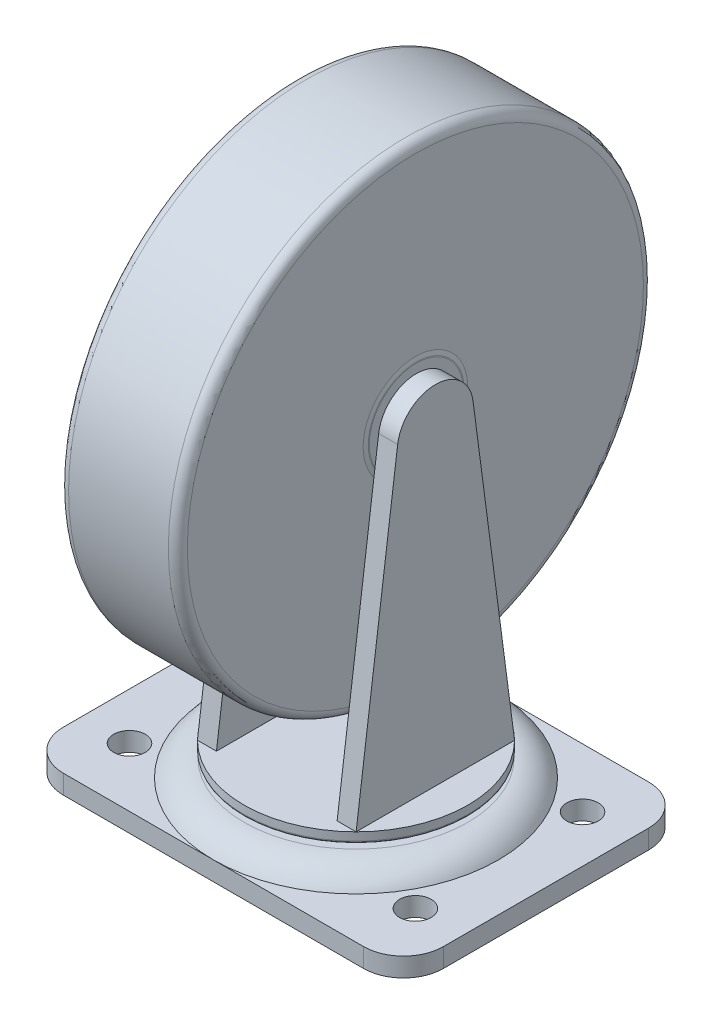
ISO-10303-21;
HEADER;
FILE_DESCRIPTION(('STEP AP214'),'2;1');
FILE_NAME('part.step','',(''),(''),'','','');
FILE_SCHEMA(('AUTOMOTIVE_DESIGN { 1 0 10303 214 1 1 1 1 }'));
ENDSEC;
DATA;
#1=APPLICATION_CONTEXT('core data for automotive mechanical design processes');
#2=APPLICATION_PROTOCOL_DEFINITION('international standard','automotive_design',2000,#1);
#3=PRODUCT_CONTEXT('',#1,'mechanical');
#4=PRODUCT('Part','Part','',(#3));
#5=PRODUCT_RELATED_PRODUCT_CATEGORY('part','',(#4));
#6=PRODUCT_DEFINITION_FORMATION('','',#4);
#7=PRODUCT_DEFINITION_CONTEXT('part definition',#1,'design');
#8=PRODUCT_DEFINITION('design','',#6,#7);
#9=PRODUCT_DEFINITION_SHAPE('','',#8);
#10=(LENGTH_UNIT() NAMED_UNIT(*) SI_UNIT(.MILLI.,.METRE.));
#11=(NAMED_UNIT(*) PLANE_ANGLE_UNIT() SI_UNIT($,.RADIAN.));
#12=(NAMED_UNIT(*) SI_UNIT($,.STERADIAN.) SOLID_ANGLE_UNIT());
#13=UNCERTAINTY_MEASURE_WITH_UNIT(LENGTH_MEASURE(1.E-05),#10,'distance_accuracy_value','');
#14=(GEOMETRIC_REPRESENTATION_CONTEXT(3) GLOBAL_UNCERTAINTY_ASSIGNED_CONTEXT((#13)) GLOBAL_UNIT_ASSIGNED_CONTEXT((#10,
#11,#12)) REPRESENTATION_CONTEXT('',''));
#15=CARTESIAN_POINT('',(0.,0.,0.));
#16=DIRECTION('',(0.,0.,1.));
#17=DIRECTION('',(1.,0.,0.));
#18=AXIS2_PLACEMENT_3D('',#15,#16,#17);
#19=CARTESIAN_POINT('',(16.129,96.5200000000001,0.));
#20=DIRECTION('',(-1.,0.,0.));
#21=DIRECTION('',(0.,0.,1.));
#22=AXIS2_PLACEMENT_3D('',#19,#20,#21);
#23=PLANE('',#22);
#24=DIRECTION('',(0.,0.99140092685626,-0.130859475119491));
#25=VECTOR('',#24,1.);
#26=CARTESIAN_POINT('',(16.129,97.8495322672141,10.0726334168597));
#27=LINE('',#26,#25);
#28=CARTESIAN_POINT('',(16.1290000000001,13.716,21.1777974067181));
#29=VERTEX_POINT('',#28);
#30=CARTESIAN_POINT('',(16.129,90.5047270894417,11.0421073444926));
#31=VERTEX_POINT('',#30);
#32=EDGE_CURVE('E240',#29,#31,#27,.T.);
#33=ORIENTED_EDGE('',*,*,#32,.T.);
#34=CARTESIAN_POINT('',(16.129,96.5200000000001,0.));
#35=DIRECTION('',(-1.,0.,0.));
#36=DIRECTION('',(0.,0.,1.));
#37=AXIS2_PLACEMENT_3D('',#34,#35,#36);
#38=CIRCLE('',#37,12.5742452177375);
#39=CARTESIAN_POINT('',(16.129,90.5047270894418,-11.0421073444925));
#40=VERTEX_POINT('',#39);
#41=EDGE_CURVE('E204',#40,#31,#38,.T.);
#42=ORIENTED_EDGE('',*,*,#41,.F.);
#43=DIRECTION('',(0.,-0.99140092685626,-0.130859475119493));
#44=VECTOR('',#43,1.);
#45=CARTESIAN_POINT('',(16.129,97.8495322672142,-10.0726334168597));
#46=LINE('',#45,#44);
#47=CARTESIAN_POINT('',(16.1289999999999,13.716,-21.1777974067182));
#48=VERTEX_POINT('',#47);
#49=EDGE_CURVE('E233',#40,#48,#46,.T.);
#50=ORIENTED_EDGE('',*,*,#49,.T.);
#51=DIRECTION('',(0.,0.,1.));
#52=VECTOR('',#51,1.);
#53=CARTESIAN_POINT('',(16.1290000000001,13.716,21.1777974067181));
#54=LINE('',#53,#52);
#55=EDGE_CURVE('E237',#48,#29,#54,.T.);
#56=ORIENTED_EDGE('',*,*,#55,.T.);
#57=EDGE_LOOP('',(#33,#42,#50,#56));
#58=FACE_BOUND('',#57,.T.);
#59=ADVANCED_FACE('F34',(#58),#23,.T.);
#60=CARTESIAN_POINT('',(-29.972,13.716,0.));
#61=DIRECTION('',(0.,1.,0.));
#62=DIRECTION('',(-1.,0.,0.));
#63=AXIS2_PLACEMENT_3D('',#60,#61,#62);
#64=PLANE('',#63);
#65=CARTESIAN_POINT('',(0.,13.716,0.));
#66=DIRECTION('',(0.,1.,0.));
#67=DIRECTION('',(-1.,0.,0.));
#68=AXIS2_PLACEMENT_3D('',#65,#66,#67);
#69=CIRCLE('',#68,29.972);
#70=CARTESIAN_POINT('',(-21.2090000000001,13.716,-21.1777974067181));
#71=VERTEX_POINT('',#70);
#72=CARTESIAN_POINT('',(-21.2089999999999,13.716,21.1777974067183));
#73=VERTEX_POINT('',#72);
#74=EDGE_CURVE('E571',#71,#73,#69,.T.);
#75=ORIENTED_EDGE('',*,*,#74,.T.);
#76=DIRECTION('',(0.,0.,1.));
#77=VECTOR('',#76,1.);
#78=CARTESIAN_POINT('',(-21.2089999999999,13.716,21.1777974067183));
#79=LINE('',#78,#77);
#80=EDGE_CURVE('E218',#71,#73,#79,.T.);
#81=ORIENTED_EDGE('',*,*,#80,.F.);
#82=EDGE_LOOP('',(#75,#81));
#83=FACE_BOUND('',#82,.T.);
#84=ADVANCED_FACE('F395',(#83),#64,.T.);
#85=CARTESIAN_POINT('',(21.2090000000001,13.716,21.1777974067181));
#86=VERTEX_POINT('',#85);
#87=CARTESIAN_POINT('',(21.2089999999999,13.716,-21.1777974067183));
#88=VERTEX_POINT('',#87);
#89=EDGE_CURVE('E265',#86,#88,#69,.T.);
#90=ORIENTED_EDGE('',*,*,#89,.T.);
#91=DIRECTION('',(0.,0.,1.));
#92=VECTOR('',#91,1.);
#93=CARTESIAN_POINT('',(21.2090000000001,13.716,21.1777974067181));
#94=LINE('',#93,#92);
#95=EDGE_CURVE('E249',#88,#86,#94,.T.);
#96=ORIENTED_EDGE('',*,*,#95,.T.);
#97=EDGE_LOOP('',(#90,#96));
#98=FACE_BOUND('',#97,.T.);
#99=ADVANCED_FACE('F401',(#98),#64,.T.);
#100=CARTESIAN_POINT('',(-40.132,5.08,27.432));
#101=DIRECTION('',(0.,1.,0.));
#102=DIRECTION('',(0.,0.,1.));
#103=AXIS2_PLACEMENT_3D('',#100,#101,#102);
#104=PLANE('',#103);
#105=CARTESIAN_POINT('',(-38.2143,5.08,22.3393));
#106=DIRECTION('',(0.,1.,0.));
#107=DIRECTION('',(0.,0.,1.));
#108=AXIS2_PLACEMENT_3D('',#105,#106,#107);
#109=CIRCLE('',#108,4.2164);
#110=CARTESIAN_POINT('',(-38.2143,5.08,26.5557));
#111=VERTEX_POINT('',#110);
#112=EDGE_CURVE('E289',#111,#111,#109,.T.);
#113=ORIENTED_EDGE('',*,*,#112,.F.);
#114=EDGE_LOOP('',(#113));
#115=FACE_BOUND('',#114,.T.);
#116=CARTESIAN_POINT('',(-38.2143,5.08,-22.3393));
#117=DIRECTION('',(0.,1.,0.));
#118=DIRECTION('',(0.,0.,1.));
#119=AXIS2_PLACEMENT_3D('',#116,#117,#118);
#120=CIRCLE('',#119,4.2164);
#121=CARTESIAN_POINT('',(-38.2143,5.08,-18.1229));
#122=VERTEX_POINT('',#121);
#123=EDGE_CURVE('E295',#122,#122,#120,.T.);
#124=ORIENTED_EDGE('',*,*,#123,.F.);
#125=EDGE_LOOP('',(#124));
#126=FACE_BOUND('',#125,.T.);
#127=DIRECTION('',(1.,0.,0.));
#128=VECTOR('',#127,1.);
#129=CARTESIAN_POINT('',(-40.132,5.08,38.1));
#130=LINE('',#129,#128);
#131=CARTESIAN_POINT('',(-40.132,5.08,38.1));
#132=VERTEX_POINT('',#131);
#133=CARTESIAN_POINT('',(0.,5.08,38.1));
#134=VERTEX_POINT('',#133);
#135=EDGE_CURVE('E312',#132,#134,#130,.T.);
#136=ORIENTED_EDGE('',*,*,#135,.T.);
#137=CARTESIAN_POINT('',(0.,5.08,0.));
#138=DIRECTION('',(0.,-1.,0.));
#139=DIRECTION('',(0.,0.,-1.));
#140=AXIS2_PLACEMENT_3D('',#137,#138,#139);
#141=CIRCLE('',#140,38.1);
#142=CARTESIAN_POINT('',(0.,5.08,-38.1));
#143=VERTEX_POINT('',#142);
#144=EDGE_CURVE('E275',#134,#143,#141,.T.);
#145=ORIENTED_EDGE('',*,*,#144,.T.);
#146=DIRECTION('',(-1.,0.,0.));
#147=VECTOR('',#146,1.);
#148=CARTESIAN_POINT('',(-40.132,5.08,-38.1));
#149=LINE('',#148,#147);
#150=CARTESIAN_POINT('',(-40.132,5.08,-38.1));
#151=VERTEX_POINT('',#150);
#152=EDGE_CURVE('E321',#143,#151,#149,.T.);
#153=ORIENTED_EDGE('',*,*,#152,.T.);
#154=CARTESIAN_POINT('',(-40.132,5.08,-27.432));
#155=DIRECTION('',(0.,1.,0.));
#156=DIRECTION('',(0.,0.,1.));
#157=AXIS2_PLACEMENT_3D('',#154,#155,#156);
#158=CIRCLE('',#157,10.668);
#159=CARTESIAN_POINT('',(-50.8,5.08,-27.432));
#160=VERTEX_POINT('',#159);
#161=EDGE_CURVE('E325',#151,#160,#158,.T.);
#162=ORIENTED_EDGE('',*,*,#161,.T.);
#163=DIRECTION('',(0.,0.,1.));
#164=VECTOR('',#163,1.);
#165=CARTESIAN_POINT('',(-50.8,5.08,-27.432));
#166=LINE('',#165,#164);
#167=CARTESIAN_POINT('',(-50.8,5.08,27.432));
#168=VERTEX_POINT('',#167);
#169=EDGE_CURVE('E327',#160,#168,#166,.T.);
#170=ORIENTED_EDGE('',*,*,#169,.T.);
#171=CARTESIAN_POINT('',(-40.132,5.08,27.432));
#172=DIRECTION('',(0.,1.,0.));
#173=DIRECTION('',(0.,0.,1.));
#174=AXIS2_PLACEMENT_3D('',#171,#172,#173);
#175=CIRCLE('',#174,10.668);
#176=EDGE_CURVE('E307',#168,#132,#175,.T.);
#177=ORIENTED_EDGE('',*,*,#176,.T.);
#178=EDGE_LOOP('',(#136,#145,#153,#162,#170,#177));
#179=FACE_BOUND('',#178,.T.);
#180=ADVANCED_FACE('F462',(#115,#126,#179),#104,.T.);
#181=CARTESIAN_POINT('',(38.2143,5.08,22.3393));
#182=DIRECTION('',(0.,1.,0.));
#183=DIRECTION('',(0.,0.,1.));
#184=AXIS2_PLACEMENT_3D('',#181,#182,#183);
#185=CIRCLE('',#184,4.2164);
#186=CARTESIAN_POINT('',(38.2143,5.08,26.5557));
#187=VERTEX_POINT('',#186);
#188=EDGE_CURVE('E283',#187,#187,#185,.T.);
#189=ORIENTED_EDGE('',*,*,#188,.F.);
#190=EDGE_LOOP('',(#189));
#191=FACE_BOUND('',#190,.T.);
#192=CARTESIAN_POINT('',(38.2143,5.08,-22.3393));
#193=DIRECTION('',(0.,1.,0.));
#194=DIRECTION('',(0.,0.,1.));
#195=AXIS2_PLACEMENT_3D('',#192,#193,#194);
#196=CIRCLE('',#195,4.2164);
#197=CARTESIAN_POINT('',(38.2143,5.08,-18.1229));
#198=VERTEX_POINT('',#197);
#199=EDGE_CURVE('E301',#198,#198,#196,.T.);
#200=ORIENTED_EDGE('',*,*,#199,.F.);
#201=EDGE_LOOP('',(#200));
#202=FACE_BOUND('',#201,.T.);
#203=CARTESIAN_POINT('',(40.132,5.08,-38.1));
#204=VERTEX_POINT('',#203);
#205=EDGE_CURVE('E322',#204,#143,#149,.T.);
#206=ORIENTED_EDGE('',*,*,#205,.T.);
#207=EDGE_CURVE('E276',#143,#134,#141,.T.);
#208=ORIENTED_EDGE('',*,*,#207,.T.);
#209=CARTESIAN_POINT('',(40.132,5.08,38.1));
#210=VERTEX_POINT('',#209);
#211=EDGE_CURVE('E310',#134,#210,#130,.T.);
#212=ORIENTED_EDGE('',*,*,#211,.T.);
#213=CARTESIAN_POINT('',(40.132,5.08,27.432));
#214=DIRECTION('',(0.,1.,0.));
#215=DIRECTION('',(0.,0.,1.));
#216=AXIS2_PLACEMENT_3D('',#213,#214,#215);
#217=CIRCLE('',#216,10.668);
#218=CARTESIAN_POINT('',(50.8,5.08,27.432));
#219=VERTEX_POINT('',#218);
#220=EDGE_CURVE('E315',#210,#219,#217,.T.);
#221=ORIENTED_EDGE('',*,*,#220,.T.);
#222=DIRECTION('',(0.,0.,-1.));
#223=VECTOR('',#222,1.);
#224=CARTESIAN_POINT('',(50.8,5.08,-27.432));
#225=LINE('',#224,#223);
#226=CARTESIAN_POINT('',(50.8,5.08,-27.432));
#227=VERTEX_POINT('',#226);
#228=EDGE_CURVE('E317',#219,#227,#225,.T.);
#229=ORIENTED_EDGE('',*,*,#228,.T.);
#230=CARTESIAN_POINT('',(40.132,5.08,-27.432));
#231=DIRECTION('',(0.,1.,0.));
#232=DIRECTION('',(0.,0.,-1.));
#233=AXIS2_PLACEMENT_3D('',#230,#231,#232);
#234=CIRCLE('',#233,10.668);
#235=EDGE_CURVE('E319',#227,#204,#234,.T.);
#236=ORIENTED_EDGE('',*,*,#235,.T.);
#237=EDGE_LOOP('',(#206,#208,#212,#221,#229,#236));
#238=FACE_BOUND('',#237,.T.);
#239=ADVANCED_FACE('F465',(#191,#202,#238),#104,.T.);
#240=CARTESIAN_POINT('',(-40.132,0.,27.432));
#241=DIRECTION('',(0.,1.,0.));
#242=DIRECTION('',(0.,0.,1.));
#243=AXIS2_PLACEMENT_3D('',#240,#241,#242);
#244=PLANE('',#243);
#245=CARTESIAN_POINT('',(-40.132,0.,27.432));
#246=DIRECTION('',(0.,1.,0.));
#247=DIRECTION('',(0.,0.,1.));
#248=AXIS2_PLACEMENT_3D('',#245,#246,#247);
#249=CIRCLE('',#248,10.668);
#250=CARTESIAN_POINT('',(-50.8,0.,27.432));
#251=VERTEX_POINT('',#250);
#252=CARTESIAN_POINT('',(-40.132,0.,38.1));
#253=VERTEX_POINT('',#252);
#254=EDGE_CURVE('E304',#251,#253,#249,.T.);
#255=ORIENTED_EDGE('',*,*,#254,.F.);
#256=DIRECTION('',(0.,0.,1.));
#257=VECTOR('',#256,1.);
#258=CARTESIAN_POINT('',(-50.8,0.,-27.432));
#259=LINE('',#258,#257);
#260=CARTESIAN_POINT('',(-50.8,0.,-27.432));
#261=VERTEX_POINT('',#260);
#262=EDGE_CURVE('E311',#261,#251,#259,.T.);
#263=ORIENTED_EDGE('',*,*,#262,.F.);
#264=CARTESIAN_POINT('',(-40.132,0.,-27.432));
#265=DIRECTION('',(0.,1.,0.));
#266=DIRECTION('',(0.,0.,1.));
#267=AXIS2_PLACEMENT_3D('',#264,#265,#266);
#268=CIRCLE('',#267,10.668);
#269=CARTESIAN_POINT('',(-40.132,0.,-38.1));
#270=VERTEX_POINT('',#269);
#271=EDGE_CURVE('E342',#270,#261,#268,.T.);
#272=ORIENTED_EDGE('',*,*,#271,.F.);
#273=DIRECTION('',(-1.,0.,0.));
#274=VECTOR('',#273,1.);
#275=CARTESIAN_POINT('',(-40.132,0.,-38.1));
#276=LINE('',#275,#274);
#277=CARTESIAN_POINT('',(40.132,0.,-38.1));
#278=VERTEX_POINT('',#277);
#279=EDGE_CURVE('E340',#278,#270,#276,.T.);
#280=ORIENTED_EDGE('',*,*,#279,.F.);
#281=CARTESIAN_POINT('',(40.132,0.,-27.432));
#282=DIRECTION('',(0.,1.,0.));
#283=DIRECTION('',(0.,0.,-1.));
#284=AXIS2_PLACEMENT_3D('',#281,#282,#283);
#285=CIRCLE('',#284,10.668);
#286=CARTESIAN_POINT('',(50.8,0.,-27.432));
#287=VERTEX_POINT('',#286);
#288=EDGE_CURVE('E338',#287,#278,#285,.T.);
#289=ORIENTED_EDGE('',*,*,#288,.F.);
#290=DIRECTION('',(0.,0.,-1.));
#291=VECTOR('',#290,1.);
#292=CARTESIAN_POINT('',(50.8,0.,-27.432));
#293=LINE('',#292,#291);
#294=CARTESIAN_POINT('',(50.8,0.,27.432));
#295=VERTEX_POINT('',#294);
#296=EDGE_CURVE('E336',#295,#287,#293,.T.);
#297=ORIENTED_EDGE('',*,*,#296,.F.);
#298=CARTESIAN_POINT('',(40.132,0.,27.432));
#299=DIRECTION('',(0.,1.,0.));
#300=DIRECTION('',(0.,0.,1.));
#301=AXIS2_PLACEMENT_3D('',#298,#299,#300);
#302=CIRCLE('',#301,10.668);
#303=CARTESIAN_POINT('',(40.132,0.,38.1));
#304=VERTEX_POINT('',#303);
#305=EDGE_CURVE('E334',#304,#295,#302,.T.);
#306=ORIENTED_EDGE('',*,*,#305,.F.);
#307=DIRECTION('',(1.,0.,0.));
#308=VECTOR('',#307,1.);
#309=CARTESIAN_POINT('',(-40.132,0.,38.1));
#310=LINE('',#309,#308);
#311=EDGE_CURVE('E332',#253,#304,#310,.T.);
#312=ORIENTED_EDGE('',*,*,#311,.F.);
#313=EDGE_LOOP('',(#255,#263,#272,#280,#289,#297,#306,#312));
#314=FACE_BOUND('',#313,.T.);
#315=CARTESIAN_POINT('',(38.2143,0.,-22.3393));
#316=DIRECTION('',(0.,1.,0.));
#317=DIRECTION('',(0.,0.,1.));
#318=AXIS2_PLACEMENT_3D('',#315,#316,#317);
#319=CIRCLE('',#318,4.2164);
#320=CARTESIAN_POINT('',(38.2143,0.,-18.1229));
#321=VERTEX_POINT('',#320);
#322=EDGE_CURVE('E298',#321,#321,#319,.T.);
#323=ORIENTED_EDGE('',*,*,#322,.T.);
#324=EDGE_LOOP('',(#323));
#325=FACE_BOUND('',#324,.T.);
#326=CARTESIAN_POINT('',(-38.2143,0.,-22.3393));
#327=DIRECTION('',(0.,1.,0.));
#328=DIRECTION('',(0.,0.,1.));
#329=AXIS2_PLACEMENT_3D('',#326,#327,#328);
#330=CIRCLE('',#329,4.2164);
#331=CARTESIAN_POINT('',(-38.2143,0.,-18.1229));
#332=VERTEX_POINT('',#331);
#333=EDGE_CURVE('E292',#332,#332,#330,.T.);
#334=ORIENTED_EDGE('',*,*,#333,.T.);
#335=EDGE_LOOP('',(#334));
#336=FACE_BOUND('',#335,.T.);
#337=CARTESIAN_POINT('',(-38.2143,0.,22.3393));
#338=DIRECTION('',(0.,1.,0.));
#339=DIRECTION('',(0.,0.,1.));
#340=AXIS2_PLACEMENT_3D('',#337,#338,#339);
#341=CIRCLE('',#340,4.2164);
#342=CARTESIAN_POINT('',(-38.2143,0.,26.5557));
#343=VERTEX_POINT('',#342);
#344=EDGE_CURVE('E286',#343,#343,#341,.T.);
#345=ORIENTED_EDGE('',*,*,#344,.T.);
#346=EDGE_LOOP('',(#345));
#347=FACE_BOUND('',#346,.T.);
#348=CARTESIAN_POINT('',(38.2143,0.,22.3393));
#349=DIRECTION('',(0.,1.,0.));
#350=DIRECTION('',(0.,0.,1.));
#351=AXIS2_PLACEMENT_3D('',#348,#349,#350);
#352=CIRCLE('',#351,4.2164);
#353=CARTESIAN_POINT('',(38.2143,0.,26.5557));
#354=VERTEX_POINT('',#353);
#355=EDGE_CURVE('E282',#354,#354,#352,.T.);
#356=ORIENTED_EDGE('',*,*,#355,.T.);
#357=EDGE_LOOP('',(#356));
#358=FACE_BOUND('',#357,.T.);
#359=ADVANCED_FACE('F467',(#314,#325,#336,#347,#358),#244,.F.);
#360=CARTESIAN_POINT('',(-40.132,5.08,27.432));
#361=DIRECTION('',(0.,-1.,0.));
#362=DIRECTION('',(0.,0.,-1.));
#363=AXIS2_PLACEMENT_3D('',#360,#361,#362);
#364=CYLINDRICAL_SURFACE('',#363,10.668);
#365=ORIENTED_EDGE('',*,*,#254,.T.);
#366=DIRECTION('',(0.,-1.,0.));
#367=VECTOR('',#366,1.);
#368=CARTESIAN_POINT('',(-40.132,5.08,38.1));
#369=LINE('',#368,#367);
#370=EDGE_CURVE('E365',#132,#253,#369,.T.);
#371=ORIENTED_EDGE('',*,*,#370,.F.);
#372=ORIENTED_EDGE('',*,*,#176,.F.);
#373=DIRECTION('',(0.,-1.,0.));
#374=VECTOR('',#373,1.);
#375=CARTESIAN_POINT('',(-50.8,5.08,27.432));
#376=LINE('',#375,#374);
#377=EDGE_CURVE('E329',#168,#251,#376,.T.);
#378=ORIENTED_EDGE('',*,*,#377,.T.);
#379=EDGE_LOOP('',(#365,#371,#372,#378));
#380=FACE_BOUND('',#379,.T.);
#381=ADVANCED_FACE('F470',(#380),#364,.T.);
#382=CARTESIAN_POINT('',(-40.132,5.08,38.1));
#383=DIRECTION('',(0.,0.,-1.));
#384=DIRECTION('',(-1.,0.,0.));
#385=AXIS2_PLACEMENT_3D('',#382,#383,#384);
#386=PLANE('',#385);
#387=ORIENTED_EDGE('',*,*,#311,.T.);
#388=DIRECTION('',(0.,-1.,0.));
#389=VECTOR('',#388,1.);
#390=CARTESIAN_POINT('',(40.132,5.08,38.1));
#391=LINE('',#390,#389);
#392=EDGE_CURVE('E362',#210,#304,#391,.T.);
#393=ORIENTED_EDGE('',*,*,#392,.F.);
#394=ORIENTED_EDGE('',*,*,#211,.F.);
#395=ORIENTED_EDGE('',*,*,#135,.F.);
#396=ORIENTED_EDGE('',*,*,#370,.T.);
#397=EDGE_LOOP('',(#387,#393,#394,#395,#396));
#398=FACE_BOUND('',#397,.T.);
#399=ADVANCED_FACE('F494',(#398),#386,.F.);
#400=CARTESIAN_POINT('',(40.132,5.08,27.432));
#401=DIRECTION('',(0.,-1.,0.));
#402=DIRECTION('',(0.,0.,-1.));
#403=AXIS2_PLACEMENT_3D('',#400,#401,#402);
#404=CYLINDRICAL_SURFACE('',#403,10.668);
#405=ORIENTED_EDGE('',*,*,#305,.T.);
#406=DIRECTION('',(0.,-1.,0.));
#407=VECTOR('',#406,1.);
#408=CARTESIAN_POINT('',(50.8,5.08,27.432));
#409=LINE('',#408,#407);
#410=EDGE_CURVE('E359',#219,#295,#409,.T.);
#411=ORIENTED_EDGE('',*,*,#410,.F.);
#412=ORIENTED_EDGE('',*,*,#220,.F.);
#413=ORIENTED_EDGE('',*,*,#392,.T.);
#414=EDGE_LOOP('',(#405,#411,#412,#413));
#415=FACE_BOUND('',#414,.T.);
#416=ADVANCED_FACE('F490',(#415),#404,.T.);
#417=CARTESIAN_POINT('',(50.8,5.08,-27.432));
#418=DIRECTION('',(-1.,0.,0.));
#419=DIRECTION('',(0.,0.,1.));
#420=AXIS2_PLACEMENT_3D('',#417,#418,#419);
#421=PLANE('',#420);
#422=ORIENTED_EDGE('',*,*,#296,.T.);
#423=DIRECTION('',(0.,-1.,0.));
#424=VECTOR('',#423,1.);
#425=CARTESIAN_POINT('',(50.8,5.08,-27.432));
#426=LINE('',#425,#424);
#427=EDGE_CURVE('E356',#227,#287,#426,.T.);
#428=ORIENTED_EDGE('',*,*,#427,.F.);
#429=ORIENTED_EDGE('',*,*,#228,.F.);
#430=ORIENTED_EDGE('',*,*,#410,.T.);
#431=EDGE_LOOP('',(#422,#428,#429,#430));
#432=FACE_BOUND('',#431,.T.);
#433=ADVANCED_FACE('F486',(#432),#421,.F.);
#434=CARTESIAN_POINT('',(40.132,5.08,-27.432));
#435=DIRECTION('',(0.,-1.,0.));
#436=DIRECTION('',(0.,0.,-1.));
#437=AXIS2_PLACEMENT_3D('',#434,#435,#436);
#438=CYLINDRICAL_SURFACE('',#437,10.668);
#439=ORIENTED_EDGE('',*,*,#288,.T.);
#440=DIRECTION('',(0.,-1.,0.));
#441=VECTOR('',#440,1.);
#442=CARTESIAN_POINT('',(40.132,5.08,-38.1));
#443=LINE('',#442,#441);
#444=EDGE_CURVE('E353',#204,#278,#443,.T.);
#445=ORIENTED_EDGE('',*,*,#444,.F.);
#446=ORIENTED_EDGE('',*,*,#235,.F.);
#447=ORIENTED_EDGE('',*,*,#427,.T.);
#448=EDGE_LOOP('',(#439,#445,#446,#447));
#449=FACE_BOUND('',#448,.T.);
#450=ADVANCED_FACE('F482',(#449),#438,.T.);
#451=CARTESIAN_POINT('',(-40.132,5.08,-38.1));
#452=DIRECTION('',(0.,0.,1.));
#453=DIRECTION('',(1.,0.,0.));
#454=AXIS2_PLACEMENT_3D('',#451,#452,#453);
#455=PLANE('',#454);
#456=ORIENTED_EDGE('',*,*,#279,.T.);
#457=DIRECTION('',(0.,-1.,0.));
#458=VECTOR('',#457,1.);
#459=CARTESIAN_POINT('',(-40.132,5.08,-38.1));
#460=LINE('',#459,#458);
#461=EDGE_CURVE('E350',#151,#270,#460,.T.);
#462=ORIENTED_EDGE('',*,*,#461,.F.);
#463=ORIENTED_EDGE('',*,*,#152,.F.);
#464=ORIENTED_EDGE('',*,*,#205,.F.);
#465=ORIENTED_EDGE('',*,*,#444,.T.);
#466=EDGE_LOOP('',(#456,#462,#463,#464,#465));
#467=FACE_BOUND('',#466,.T.);
#468=ADVANCED_FACE('F478',(#467),#455,.F.);
#469=CARTESIAN_POINT('',(-40.132,5.08,-27.432));
#470=DIRECTION('',(0.,-1.,0.));
#471=DIRECTION('',(0.,0.,-1.));
#472=AXIS2_PLACEMENT_3D('',#469,#470,#471);
#473=CYLINDRICAL_SURFACE('',#472,10.668);
#474=ORIENTED_EDGE('',*,*,#271,.T.);
#475=DIRECTION('',(0.,-1.,0.));
#476=VECTOR('',#475,1.);
#477=CARTESIAN_POINT('',(-50.8,5.08,-27.432));
#478=LINE('',#477,#476);
#479=EDGE_CURVE('E347',#160,#261,#478,.T.);
#480=ORIENTED_EDGE('',*,*,#479,.F.);
#481=ORIENTED_EDGE('',*,*,#161,.F.);
#482=ORIENTED_EDGE('',*,*,#461,.T.);
#483=EDGE_LOOP('',(#474,#480,#481,#482));
#484=FACE_BOUND('',#483,.T.);
#485=ADVANCED_FACE('F474',(#484),#473,.T.);
#486=CARTESIAN_POINT('',(-50.8,5.08,-27.432));
#487=DIRECTION('',(1.,0.,0.));
#488=DIRECTION('',(0.,0.,-1.));
#489=AXIS2_PLACEMENT_3D('',#486,#487,#488);
#490=PLANE('',#489);
#491=ORIENTED_EDGE('',*,*,#262,.T.);
#492=ORIENTED_EDGE('',*,*,#377,.F.);
#493=ORIENTED_EDGE('',*,*,#169,.F.);
#494=ORIENTED_EDGE('',*,*,#479,.T.);
#495=EDGE_LOOP('',(#491,#492,#493,#494));
#496=FACE_BOUND('',#495,.T.);
#497=ADVANCED_FACE('F460',(#496),#490,.F.);
#498=CARTESIAN_POINT('',(38.2143,5.08,-22.3393));
#499=DIRECTION('',(0.,-1.,0.));
#500=DIRECTION('',(0.,0.,-1.));
#501=AXIS2_PLACEMENT_3D('',#498,#499,#500);
#502=CYLINDRICAL_SURFACE('',#501,4.2164);
#503=ORIENTED_EDGE('',*,*,#199,.T.);
#504=EDGE_LOOP('',(#503));
#505=FACE_BOUND('',#504,.T.);
#506=ORIENTED_EDGE('',*,*,#322,.F.);
#507=EDGE_LOOP('',(#506));
#508=FACE_BOUND('',#507,.T.);
#509=ADVANCED_FACE('F456',(#505,#508),#502,.F.);
#510=CARTESIAN_POINT('',(-38.2143,5.08,-22.3393));
#511=DIRECTION('',(0.,-1.,0.));
#512=DIRECTION('',(0.,0.,-1.));
#513=AXIS2_PLACEMENT_3D('',#510,#511,#512);
#514=CYLINDRICAL_SURFACE('',#513,4.2164);
#515=ORIENTED_EDGE('',*,*,#123,.T.);
#516=EDGE_LOOP('',(#515));
#517=FACE_BOUND('',#516,.T.);
#518=ORIENTED_EDGE('',*,*,#333,.F.);
#519=EDGE_LOOP('',(#518));
#520=FACE_BOUND('',#519,.T.);
#521=ADVANCED_FACE('F452',(#517,#520),#514,.F.);
#522=CARTESIAN_POINT('',(-38.2143,5.08,22.3393));
#523=DIRECTION('',(0.,-1.,0.));
#524=DIRECTION('',(0.,0.,-1.));
#525=AXIS2_PLACEMENT_3D('',#522,#523,#524);
#526=CYLINDRICAL_SURFACE('',#525,4.2164);
#527=ORIENTED_EDGE('',*,*,#112,.T.);
#528=EDGE_LOOP('',(#527));
#529=FACE_BOUND('',#528,.T.);
#530=ORIENTED_EDGE('',*,*,#344,.F.);
#531=EDGE_LOOP('',(#530));
#532=FACE_BOUND('',#531,.T.);
#533=ADVANCED_FACE('F448',(#529,#532),#526,.F.);
#534=CARTESIAN_POINT('',(38.2143,5.08,22.3393));
#535=DIRECTION('',(0.,-1.,0.));
#536=DIRECTION('',(0.,0.,-1.));
#537=AXIS2_PLACEMENT_3D('',#534,#535,#536);
#538=CYLINDRICAL_SURFACE('',#537,4.2164);
#539=ORIENTED_EDGE('',*,*,#188,.T.);
#540=EDGE_LOOP('',(#539));
#541=FACE_BOUND('',#540,.T.);
#542=ORIENTED_EDGE('',*,*,#355,.F.);
#543=EDGE_LOOP('',(#542));
#544=FACE_BOUND('',#543,.T.);
#545=ADVANCED_FACE('F444',(#541,#544),#538,.F.);
#546=CARTESIAN_POINT('',(0.,9.652,0.));
#547=DIRECTION('',(0.,-1.,0.));
#548=DIRECTION('',(0.,0.,-1.));
#549=AXIS2_PLACEMENT_3D('',#546,#547,#548);
#550=PLANE('',#549);
#551=CARTESIAN_POINT('',(0.,9.652,0.));
#552=DIRECTION('',(0.,1.,0.));
#553=DIRECTION('',(-1.,0.,0.));
#554=AXIS2_PLACEMENT_3D('',#551,#552,#553);
#555=CIRCLE('',#554,6.35);
#556=CARTESIAN_POINT('',(-6.35,9.652,0.));
#557=VERTEX_POINT('',#556);
#558=EDGE_CURVE('E272',#557,#557,#555,.T.);
#559=ORIENTED_EDGE('',*,*,#558,.F.);
#560=EDGE_LOOP('',(#559));
#561=FACE_BOUND('',#560,.T.);
#562=CARTESIAN_POINT('',(0.,9.652,0.));
#563=DIRECTION('',(0.,-1.,0.));
#564=DIRECTION('',(0.,0.,-1.));
#565=AXIS2_PLACEMENT_3D('',#562,#563,#564);
#566=CIRCLE('',#565,29.893008833927);
#567=CARTESIAN_POINT('',(0.,9.652,-29.893008833927));
#568=VERTEX_POINT('',#567);
#569=EDGE_CURVE('E279',#568,#568,#566,.T.);
#570=ORIENTED_EDGE('',*,*,#569,.F.);
#571=EDGE_LOOP('',(#570));
#572=FACE_BOUND('',#571,.T.);
#573=ADVANCED_FACE('F440',(#561,#572),#550,.F.);
#574=CARTESIAN_POINT('',(0.,0.,0.));
#575=DIRECTION('',(0.,-1.,0.));
#576=DIRECTION('',(0.,0.,-1.));
#577=AXIS2_PLACEMENT_3D('',#574,#575,#576);
#578=TOROIDAL_SURFACE('',#577,29.893008833927,9.652);
#579=ORIENTED_EDGE('',*,*,#207,.F.);
#580=ORIENTED_EDGE('',*,*,#144,.F.);
#581=EDGE_LOOP('',(#579,#580));
#582=FACE_BOUND('',#581,.T.);
#583=ORIENTED_EDGE('',*,*,#569,.T.);
#584=EDGE_LOOP('',(#583));
#585=FACE_BOUND('',#584,.T.);
#586=ADVANCED_FACE('F436',(#582,#585),#578,.T.);
#587=CARTESIAN_POINT('',(0.,13.716,0.));
#588=DIRECTION('',(0.,1.,0.));
#589=DIRECTION('',(-1.,0.,0.));
#590=AXIS2_PLACEMENT_3D('',#587,#588,#589);
#591=CYLINDRICAL_SURFACE('',#590,6.35);
#592=ORIENTED_EDGE('',*,*,#558,.T.);
#593=EDGE_LOOP('',(#592));
#594=FACE_BOUND('',#593,.T.);
#595=CARTESIAN_POINT('',(0.,10.922,0.));
#596=DIRECTION('',(0.,1.,0.));
#597=DIRECTION('',(-1.,0.,0.));
#598=AXIS2_PLACEMENT_3D('',#595,#596,#597);
#599=CIRCLE('',#598,6.35);
#600=CARTESIAN_POINT('',(-6.35,10.922,0.));
#601=VERTEX_POINT('',#600);
#602=EDGE_CURVE('E268',#601,#601,#599,.T.);
#603=ORIENTED_EDGE('',*,*,#602,.F.);
#604=EDGE_LOOP('',(#603));
#605=FACE_BOUND('',#604,.T.);
#606=ADVANCED_FACE('F432',(#594,#605),#591,.T.);
#607=CARTESIAN_POINT('',(-6.35,10.922,0.));
#608=DIRECTION('',(0.,-1.,0.));
#609=DIRECTION('',(1.,0.,0.));
#610=AXIS2_PLACEMENT_3D('',#607,#608,#609);
#611=PLANE('',#610);
#612=CARTESIAN_POINT('',(0.,10.922,0.));
#613=DIRECTION('',(0.,-1.,0.));
#614=DIRECTION('',(1.,0.,0.));
#615=AXIS2_PLACEMENT_3D('',#612,#613,#614);
#616=CIRCLE('',#615,29.337);
#617=CARTESIAN_POINT('',(29.337,10.922,0.));
#618=VERTEX_POINT('',#617);
#619=EDGE_CURVE('E11',#618,#618,#616,.T.);
#620=ORIENTED_EDGE('',*,*,#619,.T.);
#621=EDGE_LOOP('',(#620));
#622=FACE_BOUND('',#621,.T.);
#623=ORIENTED_EDGE('',*,*,#602,.T.);
#624=EDGE_LOOP('',(#623));
#625=FACE_BOUND('',#624,.T.);
#626=ADVANCED_FACE('F429',(#622,#625),#611,.T.);
#627=CARTESIAN_POINT('',(0.,13.716,0.));
#628=DIRECTION('',(0.,1.,0.));
#629=DIRECTION('',(-1.,0.,0.));
#630=AXIS2_PLACEMENT_3D('',#627,#628,#629);
#631=CYLINDRICAL_SURFACE('',#630,29.972);
#632=CARTESIAN_POINT('',(0.,11.557,0.));
#633=DIRECTION('',(0.,-1.,0.));
#634=DIRECTION('',(1.,0.,0.));
#635=AXIS2_PLACEMENT_3D('',#632,#633,#634);
#636=CIRCLE('',#635,29.972);
#637=CARTESIAN_POINT('',(29.972,11.557,0.));
#638=VERTEX_POINT('',#637);
#639=EDGE_CURVE('E42',#638,#638,#636,.F.);
#640=ORIENTED_EDGE('',*,*,#639,.T.);
#641=EDGE_LOOP('',(#640));
#642=FACE_BOUND('',#641,.T.);
#643=ORIENTED_EDGE('',*,*,#89,.F.);
#644=EDGE_CURVE('E264',#73,#86,#69,.T.);
#645=ORIENTED_EDGE('',*,*,#644,.F.);
#646=ORIENTED_EDGE('',*,*,#74,.F.);
#647=EDGE_CURVE('E269',#88,#71,#69,.T.);
#648=ORIENTED_EDGE('',*,*,#647,.F.);
#649=EDGE_LOOP('',(#643,#645,#646,#648));
#650=FACE_BOUND('',#649,.T.);
#651=ADVANCED_FACE('F382',(#642,#650),#631,.T.);
#652=DIRECTION('',(0.,0.,1.));
#653=VECTOR('',#652,1.);
#654=CARTESIAN_POINT('',(-16.1289999999999,13.716,21.1777974067182));
#655=LINE('',#654,#653);
#656=CARTESIAN_POINT('',(-16.1290000000001,13.716,-21.1777974067181));
#657=VERTEX_POINT('',#656);
#658=CARTESIAN_POINT('',(-16.1289999999999,13.716,21.1777974067182));
#659=VERTEX_POINT('',#658);
#660=EDGE_CURVE('E180',#657,#659,#655,.T.);
#661=ORIENTED_EDGE('',*,*,#660,.T.);
#662=DIRECTION('',(-1.,0.,0.));
#663=VECTOR('',#662,1.);
#664=CARTESIAN_POINT('',(-16.1289999999999,13.716,21.1777974067182));
#665=LINE('',#664,#663);
#666=EDGE_CURVE('E225',#659,#73,#665,.T.);
#667=ORIENTED_EDGE('',*,*,#666,.T.);
#668=ORIENTED_EDGE('',*,*,#644,.T.);
#669=DIRECTION('',(1.,0.,0.));
#670=VECTOR('',#669,1.);
#671=CARTESIAN_POINT('',(16.1290000000001,13.716,21.1777974067181));
#672=LINE('',#671,#670);
#673=EDGE_CURVE('E255',#29,#86,#672,.T.);
#674=ORIENTED_EDGE('',*,*,#673,.F.);
#675=ORIENTED_EDGE('',*,*,#55,.F.);
#676=DIRECTION('',(1.,0.,0.));
#677=VECTOR('',#676,1.);
#678=CARTESIAN_POINT('',(16.1289999999999,13.716,-21.1777974067182));
#679=LINE('',#678,#677);
#680=EDGE_CURVE('E258',#48,#88,#679,.T.);
#681=ORIENTED_EDGE('',*,*,#680,.T.);
#682=ORIENTED_EDGE('',*,*,#647,.T.);
#683=DIRECTION('',(-1.,0.,0.));
#684=VECTOR('',#683,1.);
#685=CARTESIAN_POINT('',(-16.1290000000001,13.716,-21.1777974067181));
#686=LINE('',#685,#684);
#687=EDGE_CURVE('E223',#657,#71,#686,.T.);
#688=ORIENTED_EDGE('',*,*,#687,.F.);
#689=EDGE_LOOP('',(#661,#667,#668,#674,#675,#681,#682,#688));
#690=FACE_BOUND('',#689,.T.);
#691=ADVANCED_FACE('F404',(#690),#64,.T.);
#692=CARTESIAN_POINT('',(16.129,96.5200000000001,0.));
#693=DIRECTION('',(1.,0.,0.));
#694=DIRECTION('',(0.,0.,-1.));
#695=AXIS2_PLACEMENT_3D('',#692,#693,#694);
#696=CYLINDRICAL_SURFACE('',#695,10.1600000000001);
#697=CARTESIAN_POINT('',(21.209,96.5200000000001,0.));
#698=DIRECTION('',(-1.,0.,0.));
#699=DIRECTION('',(0.,0.,1.));
#700=AXIS2_PLACEMENT_3D('',#697,#698,#699);
#701=CIRCLE('',#700,10.1600000000001);
#702=CARTESIAN_POINT('',(21.209,97.8495322672141,10.0726334168597));
#703=VERTEX_POINT('',#702);
#704=CARTESIAN_POINT('',(21.209,97.8495322672142,-10.0726334168597));
#705=VERTEX_POINT('',#704);
#706=EDGE_CURVE('E230',#703,#705,#701,.T.);
#707=ORIENTED_EDGE('',*,*,#706,.T.);
#708=DIRECTION('',(1.,0.,0.));
#709=VECTOR('',#708,1.);
#710=CARTESIAN_POINT('',(16.129,97.8495322672142,-10.0726334168597));
#711=LINE('',#710,#709);
#712=CARTESIAN_POINT('',(16.129,97.8495322672142,-10.0726334168597));
#713=VERTEX_POINT('',#712);
#714=EDGE_CURVE('E261',#713,#705,#711,.T.);
#715=ORIENTED_EDGE('',*,*,#714,.F.);
#716=CARTESIAN_POINT('',(16.129,96.5200000000001,0.));
#717=DIRECTION('',(-1.,0.,0.));
#718=DIRECTION('',(0.,0.,1.));
#719=AXIS2_PLACEMENT_3D('',#716,#717,#718);
#720=CIRCLE('',#719,10.1600000000001);
#721=CARTESIAN_POINT('',(16.129,97.8495322672141,10.0726334168597));
#722=VERTEX_POINT('',#721);
#723=EDGE_CURVE('E231',#722,#713,#720,.T.);
#724=ORIENTED_EDGE('',*,*,#723,.F.);
#725=DIRECTION('',(1.,0.,0.));
#726=VECTOR('',#725,1.);
#727=CARTESIAN_POINT('',(16.129,97.8495322672141,10.0726334168597));
#728=LINE('',#727,#726);
#729=EDGE_CURVE('E243',#722,#703,#728,.T.);
#730=ORIENTED_EDGE('',*,*,#729,.T.);
#731=EDGE_LOOP('',(#707,#715,#724,#730));
#732=FACE_BOUND('',#731,.T.);
#733=ADVANCED_FACE('F420',(#732),#696,.T.);
#734=CARTESIAN_POINT('',(16.129,97.8495322672142,-10.0726334168597));
#735=DIRECTION('',(0.,-0.130859475119493,0.99140092685626));
#736=DIRECTION('',(0.,-0.99140092685626,-0.130859475119493));
#737=AXIS2_PLACEMENT_3D('',#734,#735,#736);
#738=PLANE('',#737);
#739=DIRECTION('',(0.,-0.99140092685626,-0.130859475119493));
#740=VECTOR('',#739,1.);
#741=CARTESIAN_POINT('',(21.209,97.8495322672142,-10.0726334168597));
#742=LINE('',#741,#740);
#743=EDGE_CURVE('E246',#705,#88,#742,.T.);
#744=ORIENTED_EDGE('',*,*,#743,.T.);
#745=ORIENTED_EDGE('',*,*,#680,.F.);
#746=ORIENTED_EDGE('',*,*,#49,.F.);
#747=EDGE_CURVE('E235',#713,#40,#46,.T.);
#748=ORIENTED_EDGE('',*,*,#747,.F.);
#749=ORIENTED_EDGE('',*,*,#714,.T.);
#750=EDGE_LOOP('',(#744,#745,#746,#748,#749));
#751=FACE_BOUND('',#750,.T.);
#752=ADVANCED_FACE('F416',(#751),#738,.F.);
#753=CARTESIAN_POINT('',(16.129,97.8495322672141,10.0726334168597));
#754=DIRECTION('',(0.,-0.130859475119491,-0.99140092685626));
#755=DIRECTION('',(0.,0.99140092685626,-0.130859475119491));
#756=AXIS2_PLACEMENT_3D('',#753,#754,#755);
#757=PLANE('',#756);
#758=DIRECTION('',(0.,0.99140092685626,-0.130859475119491));
#759=VECTOR('',#758,1.);
#760=CARTESIAN_POINT('',(21.209,97.8495322672141,10.0726334168597));
#761=LINE('',#760,#759);
#762=EDGE_CURVE('E234',#86,#703,#761,.T.);
#763=ORIENTED_EDGE('',*,*,#762,.T.);
#764=ORIENTED_EDGE('',*,*,#729,.F.);
#765=EDGE_CURVE('E239',#31,#722,#27,.T.);
#766=ORIENTED_EDGE('',*,*,#765,.F.);
#767=ORIENTED_EDGE('',*,*,#32,.F.);
#768=ORIENTED_EDGE('',*,*,#673,.T.);
#769=EDGE_LOOP('',(#763,#764,#766,#767,#768));
#770=FACE_BOUND('',#769,.T.);
#771=ADVANCED_FACE('F412',(#770),#757,.F.);
#772=CARTESIAN_POINT('',(21.209,96.5200000000001,0.));
#773=DIRECTION('',(-1.,0.,0.));
#774=DIRECTION('',(0.,0.,1.));
#775=AXIS2_PLACEMENT_3D('',#772,#773,#774);
#776=PLANE('',#775);
#777=ORIENTED_EDGE('',*,*,#706,.F.);
#778=ORIENTED_EDGE('',*,*,#762,.F.);
#779=ORIENTED_EDGE('',*,*,#95,.F.);
#780=ORIENTED_EDGE('',*,*,#743,.F.);
#781=EDGE_LOOP('',(#777,#778,#779,#780));
#782=FACE_BOUND('',#781,.T.);
#783=ADVANCED_FACE('F409',(#782),#776,.F.);
#784=CARTESIAN_POINT('',(-16.129,96.5200000000001,1.55433817374115E-13));
#785=DIRECTION('',(-1.,0.,0.));
#786=DIRECTION('',(0.,0.,1.));
#787=AXIS2_PLACEMENT_3D('',#784,#785,#786);
#788=CYLINDRICAL_SURFACE('',#787,10.1600000000001);
#789=CARTESIAN_POINT('',(-21.209,96.5200000000001,1.73792652876292E-13));
#790=DIRECTION('',(-1.,0.,0.));
#791=DIRECTION('',(0.,0.,1.));
#792=AXIS2_PLACEMENT_3D('',#789,#790,#791);
#793=CIRCLE('',#792,10.1600000000001);
#794=CARTESIAN_POINT('',(-21.209,97.8495322672141,10.0726334168599));
#795=VERTEX_POINT('',#794);
#796=CARTESIAN_POINT('',(-21.209,97.8495322672142,-10.0726334168595));
#797=VERTEX_POINT('',#796);
#798=EDGE_CURVE('E206',#795,#797,#793,.T.);
#799=ORIENTED_EDGE('',*,*,#798,.F.);
#800=DIRECTION('',(-1.,0.,0.));
#801=VECTOR('',#800,1.);
#802=CARTESIAN_POINT('',(-16.129,97.8495322672141,10.0726334168599));
#803=LINE('',#802,#801);
#804=CARTESIAN_POINT('',(-16.129,97.8495322672141,10.0726334168599));
#805=VERTEX_POINT('',#804);
#806=EDGE_CURVE('E228',#805,#795,#803,.T.);
#807=ORIENTED_EDGE('',*,*,#806,.F.);
#808=CARTESIAN_POINT('',(-16.129,96.5200000000001,1.55433817374115E-13));
#809=DIRECTION('',(-1.,0.,0.));
#810=DIRECTION('',(0.,0.,1.));
#811=AXIS2_PLACEMENT_3D('',#808,#809,#810);
#812=CIRCLE('',#811,10.1600000000001);
#813=CARTESIAN_POINT('',(-16.129,97.8495322672142,-10.0726334168595));
#814=VERTEX_POINT('',#813);
#815=EDGE_CURVE('E207',#805,#814,#812,.T.);
#816=ORIENTED_EDGE('',*,*,#815,.T.);
#817=DIRECTION('',(-1.,0.,0.));
#818=VECTOR('',#817,1.);
#819=CARTESIAN_POINT('',(-16.129,97.8495322672142,-10.0726334168595));
#820=LINE('',#819,#818);
#821=EDGE_CURVE('E172',#814,#797,#820,.T.);
#822=ORIENTED_EDGE('',*,*,#821,.T.);
#823=EDGE_LOOP('',(#799,#807,#816,#822));
#824=FACE_BOUND('',#823,.T.);
#825=ADVANCED_FACE('F407',(#824),#788,.T.);
#826=CARTESIAN_POINT('',(-16.129,97.8495322672141,10.0726334168599));
#827=DIRECTION('',(0.,0.130859475119491,0.99140092685626));
#828=DIRECTION('',(0.,-0.99140092685626,0.130859475119491));
#829=AXIS2_PLACEMENT_3D('',#826,#827,#828);
#830=PLANE('',#829);
#831=DIRECTION('',(0.,0.99140092685626,-0.130859475119491));
#832=VECTOR('',#831,1.);
#833=CARTESIAN_POINT('',(-21.209,97.8495322672141,10.0726334168599));
#834=LINE('',#833,#832);
#835=EDGE_CURVE('E215',#73,#795,#834,.T.);
#836=ORIENTED_EDGE('',*,*,#835,.F.);
#837=ORIENTED_EDGE('',*,*,#666,.F.);
#838=DIRECTION('',(0.,0.99140092685626,-0.130859475119491));
#839=VECTOR('',#838,1.);
#840=CARTESIAN_POINT('',(-16.129,97.8495322672141,10.0726334168599));
#841=LINE('',#840,#839);
#842=CARTESIAN_POINT('',(-16.129,90.504727089442,11.0421073444927));
#843=VERTEX_POINT('',#842);
#844=EDGE_CURVE('E210',#659,#843,#841,.T.);
#845=ORIENTED_EDGE('',*,*,#844,.T.);
#846=EDGE_CURVE('E186',#843,#805,#841,.T.);
#847=ORIENTED_EDGE('',*,*,#846,.T.);
#848=ORIENTED_EDGE('',*,*,#806,.T.);
#849=EDGE_LOOP('',(#836,#837,#845,#847,#848));
#850=FACE_BOUND('',#849,.T.);
#851=ADVANCED_FACE('F555',(#850),#830,.T.);
#852=CARTESIAN_POINT('',(-16.129,97.8495322672142,-10.0726334168595));
#853=DIRECTION('',(0.,0.130859475119493,-0.99140092685626));
#854=DIRECTION('',(0.,0.99140092685626,0.130859475119493));
#855=AXIS2_PLACEMENT_3D('',#852,#853,#854);
#856=PLANE('',#855);
#857=DIRECTION('',(0.,-0.99140092685626,-0.130859475119493));
#858=VECTOR('',#857,1.);
#859=CARTESIAN_POINT('',(-21.209,97.8495322672142,-10.0726334168595));
#860=LINE('',#859,#858);
#861=EDGE_CURVE('E209',#797,#71,#860,.T.);
#862=ORIENTED_EDGE('',*,*,#861,.F.);
#863=ORIENTED_EDGE('',*,*,#821,.F.);
#864=DIRECTION('',(0.,-0.99140092685626,-0.130859475119493));
#865=VECTOR('',#864,1.);
#866=CARTESIAN_POINT('',(-16.129,97.8495322672142,-10.0726334168595));
#867=LINE('',#866,#865);
#868=CARTESIAN_POINT('',(-16.129,90.5047270894418,-11.0421073444924));
#869=VERTEX_POINT('',#868);
#870=EDGE_CURVE('E166',#814,#869,#867,.T.);
#871=ORIENTED_EDGE('',*,*,#870,.T.);
#872=EDGE_CURVE('E170',#869,#657,#867,.T.);
#873=ORIENTED_EDGE('',*,*,#872,.T.);
#874=ORIENTED_EDGE('',*,*,#687,.T.);
#875=EDGE_LOOP('',(#862,#863,#871,#873,#874));
#876=FACE_BOUND('',#875,.T.);
#877=ADVANCED_FACE('F168',(#876),#856,.T.);
#878=CARTESIAN_POINT('',(-16.129,96.5200000000001,1.55433817374115E-13));
#879=DIRECTION('',(1.,0.,0.));
#880=DIRECTION('',(0.,0.,1.));
#881=AXIS2_PLACEMENT_3D('',#878,#879,#880);
#882=PLANE('',#881);
#883=CARTESIAN_POINT('',(-16.129,96.5200000000001,0.));
#884=DIRECTION('',(-1.,0.,0.));
#885=DIRECTION('',(0.,0.,1.));
#886=AXIS2_PLACEMENT_3D('',#883,#884,#885);
#887=CIRCLE('',#886,12.5742452177374);
#888=EDGE_CURVE('E56',#869,#843,#887,.T.);
#889=ORIENTED_EDGE('',*,*,#888,.T.);
#890=ORIENTED_EDGE('',*,*,#844,.F.);
#891=ORIENTED_EDGE('',*,*,#660,.F.);
#892=ORIENTED_EDGE('',*,*,#872,.F.);
#893=EDGE_LOOP('',(#889,#890,#891,#892));
#894=FACE_BOUND('',#893,.T.);
#895=ADVANCED_FACE('F178',(#894),#882,.T.);
#896=CARTESIAN_POINT('',(-21.209,96.5200000000001,1.73792652876292E-13));
#897=DIRECTION('',(1.,0.,0.));
#898=DIRECTION('',(0.,0.,1.));
#899=AXIS2_PLACEMENT_3D('',#896,#897,#898);
#900=PLANE('',#899);
#901=ORIENTED_EDGE('',*,*,#798,.T.);
#902=ORIENTED_EDGE('',*,*,#861,.T.);
#903=ORIENTED_EDGE('',*,*,#80,.T.);
#904=ORIENTED_EDGE('',*,*,#835,.T.);
#905=EDGE_LOOP('',(#901,#902,#903,#904));
#906=FACE_BOUND('',#905,.T.);
#907=ADVANCED_FACE('F545',(#906),#900,.F.);
#908=CARTESIAN_POINT('',(16.129,96.5200000000001,0.));
#909=DIRECTION('',(-1.,0.,0.));
#910=DIRECTION('',(0.,0.,1.));
#911=AXIS2_PLACEMENT_3D('',#908,#909,#910);
#912=PLANE('',#911);
#913=ORIENTED_EDGE('',*,*,#723,.T.);
#914=ORIENTED_EDGE('',*,*,#747,.T.);
#915=EDGE_CURVE('E48',#31,#40,#38,.T.);
#916=ORIENTED_EDGE('',*,*,#915,.F.);
#917=ORIENTED_EDGE('',*,*,#765,.T.);
#918=EDGE_LOOP('',(#913,#914,#916,#917));
#919=FACE_BOUND('',#918,.T.);
#920=ADVANCED_FACE('F542',(#919),#912,.F.);
#921=CARTESIAN_POINT('',(-16.129,96.5200000000001,-12.5742452177373));
#922=DIRECTION('',(1.,0.,0.));
#923=DIRECTION('',(0.,0.,-1.));
#924=AXIS2_PLACEMENT_3D('',#921,#922,#923);
#925=PLANE('',#924);
#926=ORIENTED_EDGE('',*,*,#846,.F.);
#927=EDGE_CURVE('E184',#843,#869,#887,.T.);
#928=ORIENTED_EDGE('',*,*,#927,.T.);
#929=ORIENTED_EDGE('',*,*,#870,.F.);
#930=ORIENTED_EDGE('',*,*,#815,.F.);
#931=EDGE_LOOP('',(#926,#928,#929,#930));
#932=FACE_BOUND('',#931,.T.);
#933=ADVANCED_FACE('F185',(#932),#925,.F.);
#934=CARTESIAN_POINT('',(14.859,96.5200000000001,0.));
#935=DIRECTION('',(-1.,0.,0.));
#936=DIRECTION('',(0.,0.,1.));
#937=AXIS2_PLACEMENT_3D('',#934,#935,#936);
#938=TOROIDAL_SURFACE('',#937,12.5742452177375,1.27);
#939=CARTESIAN_POINT('',(16.1043374581275,96.5200000000001,0.));
#940=DIRECTION('',(-1.,0.,0.));
#941=DIRECTION('',(0.,0.,1.));
#942=AXIS2_PLACEMENT_3D('',#939,#940,#941);
#943=CIRCLE('',#942,12.8233127093627);
#944=CARTESIAN_POINT('',(16.1043374581275,96.5200000000001,12.8233127093628));
#945=VERTEX_POINT('',#944);
#946=EDGE_CURVE('E201',#945,#945,#943,.T.);
#947=ORIENTED_EDGE('',*,*,#946,.F.);
#948=EDGE_LOOP('',(#947));
#949=FACE_BOUND('',#948,.T.);
#950=ORIENTED_EDGE('',*,*,#41,.T.);
#951=ORIENTED_EDGE('',*,*,#915,.T.);
#952=EDGE_LOOP('',(#950,#951));
#953=FACE_BOUND('',#952,.T.);
#954=ADVANCED_FACE('F537',(#949,#953),#938,.T.);
#955=CARTESIAN_POINT('',(16.1043374581275,96.5200000000001,0.));
#956=DIRECTION('',(-1.,0.,0.));
#957=DIRECTION('',(0.,0.,1.));
#958=AXIS2_PLACEMENT_3D('',#955,#956,#957);
#959=CONICAL_SURFACE('',#958,12.8233127093627,1.37340076694524);
#960=CARTESIAN_POINT('',(15.8750000000003,96.5200000000001,0.));
#961=DIRECTION('',(-1.,0.,0.));
#962=DIRECTION('',(0.,0.,1.));
#963=AXIS2_PLACEMENT_3D('',#960,#961,#962);
#964=CIRCLE('',#963,13.9700000000001);
#965=CARTESIAN_POINT('',(15.8750000000003,96.5200000000001,13.9700000000002));
#966=VERTEX_POINT('',#965);
#967=EDGE_CURVE('E198',#966,#966,#964,.T.);
#968=ORIENTED_EDGE('',*,*,#967,.F.);
#969=EDGE_LOOP('',(#968));
#970=FACE_BOUND('',#969,.T.);
#971=ORIENTED_EDGE('',*,*,#946,.T.);
#972=EDGE_LOOP('',(#971));
#973=FACE_BOUND('',#972,.T.);
#974=ADVANCED_FACE('F533',(#970,#973),#959,.T.);
#975=CARTESIAN_POINT('',(15.875,96.5200000000001,-13.9700000000001));
#976=DIRECTION('',(-1.,0.,0.));
#977=DIRECTION('',(0.,0.,1.));
#978=AXIS2_PLACEMENT_3D('',#975,#976,#977);
#979=PLANE('',#978);
#980=CARTESIAN_POINT('',(15.875,96.5200000000001,0.));
#981=DIRECTION('',(-1.,0.,0.));
#982=DIRECTION('',(0.,0.,1.));
#983=AXIS2_PLACEMENT_3D('',#980,#981,#982);
#984=CIRCLE('',#983,60.9600000000001);
#985=CARTESIAN_POINT('',(15.8750000000001,96.5200000000001,60.9600000000001));
#986=VERTEX_POINT('',#985);
#987=EDGE_CURVE('E377',#986,#986,#984,.F.);
#988=ORIENTED_EDGE('',*,*,#987,.T.);
#989=EDGE_LOOP('',(#988));
#990=FACE_BOUND('',#989,.T.);
#991=ORIENTED_EDGE('',*,*,#967,.T.);
#992=EDGE_LOOP('',(#991));
#993=FACE_BOUND('',#992,.T.);
#994=ADVANCED_FACE('F529',(#990,#993),#979,.F.);
#995=CARTESIAN_POINT('',(-16.129,96.5200000000001,0.));
#996=DIRECTION('',(-1.,0.,0.));
#997=DIRECTION('',(0.,0.,1.));
#998=AXIS2_PLACEMENT_3D('',#995,#996,#997);
#999=CYLINDRICAL_SURFACE('',#998,63.5000000000001);
#1000=CARTESIAN_POINT('',(-13.3350000000002,96.5200000000001,0.));
#1001=DIRECTION('',(1.,0.,0.));
#1002=DIRECTION('',(0.,0.,-1.));
#1003=AXIS2_PLACEMENT_3D('',#1000,#1001,#1002);
#1004=CIRCLE('',#1003,63.5000000000001);
#1005=CARTESIAN_POINT('',(-13.3350000000003,96.5200000000001,-63.5));
#1006=VERTEX_POINT('',#1005);
#1007=EDGE_CURVE('E374',#1006,#1006,#1004,.T.);
#1008=ORIENTED_EDGE('',*,*,#1007,.T.);
#1009=EDGE_LOOP('',(#1008));
#1010=FACE_BOUND('',#1009,.T.);
#1011=CARTESIAN_POINT('',(13.335,96.5200000000001,0.));
#1012=DIRECTION('',(-1.,0.,0.));
#1013=DIRECTION('',(0.,0.,1.));
#1014=AXIS2_PLACEMENT_3D('',#1011,#1012,#1013);
#1015=CIRCLE('',#1014,63.5000000000001);
#1016=CARTESIAN_POINT('',(13.3350000000001,96.5200000000001,63.5000000000001));
#1017=VERTEX_POINT('',#1016);
#1018=EDGE_CURVE('E371',#1017,#1017,#1015,.T.);
#1019=ORIENTED_EDGE('',*,*,#1018,.T.);
#1020=EDGE_LOOP('',(#1019));
#1021=FACE_BOUND('',#1020,.T.);
#1022=ADVANCED_FACE('F516',(#1010,#1021),#999,.T.);
#1023=CARTESIAN_POINT('',(-15.8750000000003,96.5200000000001,-63.4999999999999));
#1024=DIRECTION('',(1.,0.,0.));
#1025=DIRECTION('',(0.,0.,-1.));
#1026=AXIS2_PLACEMENT_3D('',#1023,#1024,#1025);
#1027=PLANE('',#1026);
#1028=CARTESIAN_POINT('',(-15.8750000000003,96.5200000000001,0.));
#1029=DIRECTION('',(1.,0.,0.));
#1030=DIRECTION('',(0.,0.,-1.));
#1031=AXIS2_PLACEMENT_3D('',#1028,#1029,#1030);
#1032=CIRCLE('',#1031,60.9600000000001);
#1033=CARTESIAN_POINT('',(-15.8750000000003,96.5200000000001,-60.96));
#1034=VERTEX_POINT('',#1033);
#1035=EDGE_CURVE('E368',#1034,#1034,#1032,.F.);
#1036=ORIENTED_EDGE('',*,*,#1035,.T.);
#1037=EDGE_LOOP('',(#1036));
#1038=FACE_BOUND('',#1037,.T.);
#1039=CARTESIAN_POINT('',(-15.8750000000003,96.5200000000001,0.));
#1040=DIRECTION('',(-1.,0.,0.));
#1041=DIRECTION('',(0.,0.,1.));
#1042=AXIS2_PLACEMENT_3D('',#1039,#1040,#1041);
#1043=CIRCLE('',#1042,13.9700000000001);
#1044=CARTESIAN_POINT('',(-15.8750000000003,96.5200000000001,13.9700000000002));
#1045=VERTEX_POINT('',#1044);
#1046=EDGE_CURVE('E193',#1045,#1045,#1043,.T.);
#1047=ORIENTED_EDGE('',*,*,#1046,.F.);
#1048=EDGE_LOOP('',(#1047));
#1049=FACE_BOUND('',#1048,.T.);
#1050=ADVANCED_FACE('F513',(#1038,#1049),#1027,.F.);
#1051=CARTESIAN_POINT('',(-15.8750000000003,96.5200000000001,0.));
#1052=DIRECTION('',(1.,0.,0.));
#1053=DIRECTION('',(0.,0.,-1.));
#1054=AXIS2_PLACEMENT_3D('',#1051,#1052,#1053);
#1055=CONICAL_SURFACE('',#1054,13.9700000000001,1.37340076694525);
#1056=CARTESIAN_POINT('',(-16.1043374581275,96.5200000000001,0.));
#1057=DIRECTION('',(-1.,0.,0.));
#1058=DIRECTION('',(0.,0.,1.));
#1059=AXIS2_PLACEMENT_3D('',#1056,#1057,#1058);
#1060=CIRCLE('',#1059,12.8233127093626);
#1061=CARTESIAN_POINT('',(-16.1043374581275,96.5200000000001,12.8233127093627));
#1062=VERTEX_POINT('',#1061);
#1063=EDGE_CURVE('E191',#1062,#1062,#1060,.T.);
#1064=ORIENTED_EDGE('',*,*,#1063,.F.);
#1065=EDGE_LOOP('',(#1064));
#1066=FACE_BOUND('',#1065,.T.);
#1067=ORIENTED_EDGE('',*,*,#1046,.T.);
#1068=EDGE_LOOP('',(#1067));
#1069=FACE_BOUND('',#1068,.T.);
#1070=ADVANCED_FACE('F507',(#1066,#1069),#1055,.T.);
#1071=CARTESIAN_POINT('',(-14.859,96.5200000000001,0.));
#1072=DIRECTION('',(-1.,0.,0.));
#1073=DIRECTION('',(0.,0.,1.));
#1074=AXIS2_PLACEMENT_3D('',#1071,#1072,#1073);
#1075=TOROIDAL_SURFACE('',#1074,12.5742452177374,1.27);
#1076=ORIENTED_EDGE('',*,*,#888,.F.);
#1077=ORIENTED_EDGE('',*,*,#927,.F.);
#1078=EDGE_LOOP('',(#1076,#1077));
#1079=FACE_BOUND('',#1078,.T.);
#1080=ORIENTED_EDGE('',*,*,#1063,.T.);
#1081=EDGE_LOOP('',(#1080));
#1082=FACE_BOUND('',#1081,.T.);
#1083=ADVANCED_FACE('F189',(#1079,#1082),#1075,.T.);
#1084=CARTESIAN_POINT('',(-13.3350000000002,96.5200000000001,0.));
#1085=DIRECTION('',(1.,0.,0.));
#1086=DIRECTION('',(0.,0.,-1.));
#1087=AXIS2_PLACEMENT_3D('',#1084,#1085,#1086);
#1088=TOROIDAL_SURFACE('',#1087,60.9600000000001,2.54);
#1089=ORIENTED_EDGE('',*,*,#1007,.F.);
#1090=EDGE_LOOP('',(#1089));
#1091=FACE_BOUND('',#1090,.T.);
#1092=ORIENTED_EDGE('',*,*,#1035,.F.);
#1093=EDGE_LOOP('',(#1092));
#1094=FACE_BOUND('',#1093,.T.);
#1095=ADVANCED_FACE('F391',(#1091,#1094),#1088,.T.);
#1096=CARTESIAN_POINT('',(13.335,96.5200000000001,0.));
#1097=DIRECTION('',(-1.,0.,0.));
#1098=DIRECTION('',(0.,0.,1.));
#1099=AXIS2_PLACEMENT_3D('',#1096,#1097,#1098);
#1100=TOROIDAL_SURFACE('',#1099,60.9600000000001,2.54);
#1101=ORIENTED_EDGE('',*,*,#987,.F.);
#1102=EDGE_LOOP('',(#1101));
#1103=FACE_BOUND('',#1102,.T.);
#1104=ORIENTED_EDGE('',*,*,#1018,.F.);
#1105=EDGE_LOOP('',(#1104));
#1106=FACE_BOUND('',#1105,.T.);
#1107=ADVANCED_FACE('F386',(#1103,#1106),#1100,.T.);
#1108=CARTESIAN_POINT('',(0.,11.557,0.));
#1109=DIRECTION('',(0.,-1.,0.));
#1110=DIRECTION('',(1.,0.,0.));
#1111=AXIS2_PLACEMENT_3D('',#1108,#1109,#1110);
#1112=TOROIDAL_SURFACE('',#1111,29.337,0.635);
#1113=ORIENTED_EDGE('',*,*,#619,.F.);
#1114=EDGE_LOOP('',(#1113));
#1115=FACE_BOUND('',#1114,.T.);
#1116=ORIENTED_EDGE('',*,*,#639,.F.);
#1117=EDGE_LOOP('',(#1116));
#1118=FACE_BOUND('',#1117,.T.);
#1119=ADVANCED_FACE('F36',(#1115,#1118),#1112,.T.);
#1120=CLOSED_SHELL('',(#59,#84,#99,#180,#239,#359,#381,#399,#416,#433,#450,#468,#485,#497,#509,
#521,#533,#545,#573,#586,#606,#626,#651,#691,#733,#752,#771,#783,#825,#851,#877,#895,#907,#920,
#933,#954,#974,#994,#1022,#1050,#1070,#1083,#1095,#1107,#1119));
#1121=MANIFOLD_SOLID_BREP('B2',#1120);
#1122=ADVANCED_BREP_SHAPE_REPRESENTATION('',(#18,#1121),#14);
#1123=SHAPE_DEFINITION_REPRESENTATION(#9,#1122);
ENDSEC;
END-ISO-10303-21;
